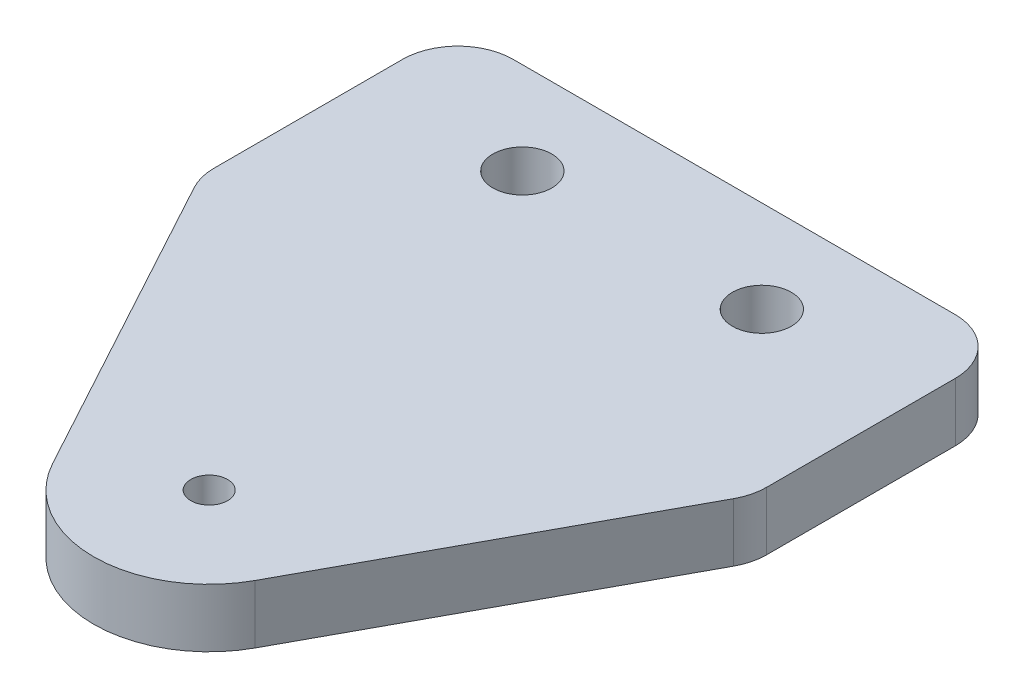
ISO-10303-21;
HEADER;
FILE_DESCRIPTION(('STEP AP214'),'2;1');
FILE_NAME('part.step','',(''),(''),'','','');
FILE_SCHEMA(('AUTOMOTIVE_DESIGN { 1 0 10303 214 1 1 1 1 }'));
ENDSEC;
DATA;
#1=APPLICATION_CONTEXT('core data for automotive mechanical design processes');
#2=APPLICATION_PROTOCOL_DEFINITION('international standard','automotive_design',2000,#1);
#3=PRODUCT_CONTEXT('',#1,'mechanical');
#4=PRODUCT('Part','Part','',(#3));
#5=PRODUCT_RELATED_PRODUCT_CATEGORY('part','',(#4));
#6=PRODUCT_DEFINITION_FORMATION('','',#4);
#7=PRODUCT_DEFINITION_CONTEXT('part definition',#1,'design');
#8=PRODUCT_DEFINITION('design','',#6,#7);
#9=PRODUCT_DEFINITION_SHAPE('','',#8);
#10=(LENGTH_UNIT() NAMED_UNIT(*) SI_UNIT(.MILLI.,.METRE.));
#11=(NAMED_UNIT(*) PLANE_ANGLE_UNIT() SI_UNIT($,.RADIAN.));
#12=(NAMED_UNIT(*) SI_UNIT($,.STERADIAN.) SOLID_ANGLE_UNIT());
#13=UNCERTAINTY_MEASURE_WITH_UNIT(LENGTH_MEASURE(1.E-05),#10,'distance_accuracy_value','');
#14=(GEOMETRIC_REPRESENTATION_CONTEXT(3) GLOBAL_UNCERTAINTY_ASSIGNED_CONTEXT((#13)) GLOBAL_UNIT_ASSIGNED_CONTEXT((#10,
#11,#12)) REPRESENTATION_CONTEXT('',''));
#15=CARTESIAN_POINT('',(0.,0.,0.));
#16=DIRECTION('',(0.,0.,1.));
#17=DIRECTION('',(1.,0.,0.));
#18=AXIS2_PLACEMENT_3D('',#15,#16,#17);
#19=CARTESIAN_POINT('',(0.,3.175,0.));
#20=DIRECTION('',(0.,1.,0.));
#21=DIRECTION('',(0.,0.,1.));
#22=AXIS2_PLACEMENT_3D('',#19,#20,#21);
#23=PLANE('',#22);
#24=DIRECTION('',(-0.477136645791675,0.,0.87882911947811));
#25=VECTOR('',#24,1.);
#26=CARTESIAN_POINT('',(21.4999999999999,3.175,9.));
#27=LINE('',#26,#25);
#28=CARTESIAN_POINT('',(21.1364873584343,3.175,9.66954717799186));
#29=VERTEX_POINT('',#28);
#30=CARTESIAN_POINT('',(11.9988454338963,3.175,26.5));
#31=VERTEX_POINT('',#30);
#32=EDGE_CURVE('E135',#29,#31,#27,.T.);
#33=ORIENTED_EDGE('',*,*,#32,.F.);
#34=CARTESIAN_POINT('',(18.4999999999999,3.175,8.23813724061684));
#35=DIRECTION('',(0.,1.,0.));
#36=DIRECTION('',(0.,0.,1.));
#37=AXIS2_PLACEMENT_3D('',#34,#35,#36);
#38=CIRCLE('',#37,3.);
#39=CARTESIAN_POINT('',(21.4999999999999,3.175,8.23813724061683));
#40=VERTEX_POINT('',#39);
#41=EDGE_CURVE('E196',#29,#40,#38,.T.);
#42=ORIENTED_EDGE('',*,*,#41,.T.);
#43=DIRECTION('',(0.,0.,-1.));
#44=VECTOR('',#43,1.);
#45=CARTESIAN_POINT('',(21.4999999999999,3.175,-5.));
#46=LINE('',#45,#44);
#47=CARTESIAN_POINT('',(21.4999999999999,3.175,-2.));
#48=VERTEX_POINT('',#47);
#49=EDGE_CURVE('E175',#40,#48,#46,.T.);
#50=ORIENTED_EDGE('',*,*,#49,.T.);
#51=CARTESIAN_POINT('',(18.4999999999999,3.175,-2.));
#52=DIRECTION('',(0.,1.,0.));
#53=DIRECTION('',(0.,0.,1.));
#54=AXIS2_PLACEMENT_3D('',#51,#52,#53);
#55=CIRCLE('',#54,3.);
#56=CARTESIAN_POINT('',(18.4999999999999,3.175,-5.));
#57=VERTEX_POINT('',#56);
#58=EDGE_CURVE('E190',#48,#57,#55,.T.);
#59=ORIENTED_EDGE('',*,*,#58,.T.);
#60=DIRECTION('',(-1.,0.,0.));
#61=VECTOR('',#60,1.);
#62=CARTESIAN_POINT('',(-8.49999999999994,3.175,-5.));
#63=LINE('',#62,#61);
#64=CARTESIAN_POINT('',(-5.49999999999994,3.175,-5.));
#65=VERTEX_POINT('',#64);
#66=EDGE_CURVE('E179',#57,#65,#63,.T.);
#67=ORIENTED_EDGE('',*,*,#66,.T.);
#68=CARTESIAN_POINT('',(-5.49999999999994,3.175,-2.));
#69=DIRECTION('',(0.,1.,0.));
#70=DIRECTION('',(0.,0.,1.));
#71=AXIS2_PLACEMENT_3D('',#68,#69,#70);
#72=CIRCLE('',#71,3.);
#73=CARTESIAN_POINT('',(-8.49999999999994,3.175,-2.));
#74=VERTEX_POINT('',#73);
#75=EDGE_CURVE('E192',#65,#74,#72,.T.);
#76=ORIENTED_EDGE('',*,*,#75,.T.);
#77=DIRECTION('',(0.,0.,1.));
#78=VECTOR('',#77,1.);
#79=CARTESIAN_POINT('',(-8.49999999999994,3.175,-5.));
#80=LINE('',#79,#78);
#81=CARTESIAN_POINT('',(-8.49999999999994,3.175,8.23813724061685));
#82=VERTEX_POINT('',#81);
#83=EDGE_CURVE('E172',#74,#82,#80,.T.);
#84=ORIENTED_EDGE('',*,*,#83,.T.);
#85=CARTESIAN_POINT('',(-5.49999999999994,3.175,8.23813724061685));
#86=DIRECTION('',(0.,1.,0.));
#87=DIRECTION('',(0.,0.,1.));
#88=AXIS2_PLACEMENT_3D('',#85,#86,#87);
#89=CIRCLE('',#88,3.);
#90=CARTESIAN_POINT('',(-8.13648735843427,3.175,9.66954717799187));
#91=VERTEX_POINT('',#90);
#92=EDGE_CURVE('E194',#82,#91,#89,.T.);
#93=ORIENTED_EDGE('',*,*,#92,.T.);
#94=DIRECTION('',(-0.477136645791675,0.,-0.878829119478109));
#95=VECTOR('',#94,1.);
#96=CARTESIAN_POINT('',(-8.49999999999994,3.175,9.));
#97=LINE('',#96,#95);
#98=CARTESIAN_POINT('',(1.00115456610374,3.175,26.5));
#99=VERTEX_POINT('',#98);
#100=EDGE_CURVE('E129',#99,#91,#97,.T.);
#101=ORIENTED_EDGE('',*,*,#100,.F.);
#102=CARTESIAN_POINT('',(6.5,3.175,23.5145496912822));
#103=DIRECTION('',(0.,-1.,0.));
#104=DIRECTION('',(0.,0.,-1.));
#105=AXIS2_PLACEMENT_3D('',#102,#103,#104);
#106=CIRCLE('',#105,6.25701323729663);
#107=EDGE_CURVE('E148',#31,#99,#106,.T.);
#108=ORIENTED_EDGE('',*,*,#107,.F.);
#109=EDGE_LOOP('',(#33,#42,#50,#59,#67,#76,#84,#93,#101,#108));
#110=FACE_BOUND('',#109,.T.);
#111=CARTESIAN_POINT('',(6.50000000000051,3.175,23.5000000000016));
#112=DIRECTION('',(0.,1.,0.));
#113=DIRECTION('',(0.,0.,1.));
#114=AXIS2_PLACEMENT_3D('',#111,#112,#113);
#115=CIRCLE('',#114,1.);
#116=CARTESIAN_POINT('',(6.50000000000051,3.175,24.5000000000016));
#117=VERTEX_POINT('',#116);
#118=EDGE_CURVE('E152',#117,#117,#115,.T.);
#119=ORIENTED_EDGE('',*,*,#118,.F.);
#120=EDGE_LOOP('',(#119));
#121=FACE_BOUND('',#120,.T.);
#122=CARTESIAN_POINT('',(0.,3.175,0.));
#123=DIRECTION('',(0.,1.,0.));
#124=DIRECTION('',(0.,0.,1.));
#125=AXIS2_PLACEMENT_3D('',#122,#123,#124);
#126=CIRCLE('',#125,1.6);
#127=CARTESIAN_POINT('',(0.,3.175,1.6));
#128=VERTEX_POINT('',#127);
#129=EDGE_CURVE('E166',#128,#128,#126,.T.);
#130=ORIENTED_EDGE('',*,*,#129,.F.);
#131=EDGE_LOOP('',(#130));
#132=FACE_BOUND('',#131,.T.);
#133=CARTESIAN_POINT('',(13.,3.175,0.));
#134=DIRECTION('',(0.,1.,0.));
#135=DIRECTION('',(0.,0.,1.));
#136=AXIS2_PLACEMENT_3D('',#133,#134,#135);
#137=CIRCLE('',#136,1.6);
#138=CARTESIAN_POINT('',(13.,3.175,1.6));
#139=VERTEX_POINT('',#138);
#140=EDGE_CURVE('E160',#139,#139,#137,.T.);
#141=ORIENTED_EDGE('',*,*,#140,.F.);
#142=EDGE_LOOP('',(#141));
#143=FACE_BOUND('',#142,.T.);
#144=ADVANCED_FACE('F39',(#110,#121,#132,#143),#23,.T.);
#145=CARTESIAN_POINT('',(0.,0.,0.));
#146=DIRECTION('',(0.,1.,0.));
#147=DIRECTION('',(0.,0.,1.));
#148=AXIS2_PLACEMENT_3D('',#145,#146,#147);
#149=PLANE('',#148);
#150=CARTESIAN_POINT('',(6.50000000000051,0.,23.5000000000016));
#151=DIRECTION('',(0.,1.,0.));
#152=DIRECTION('',(0.,0.,1.));
#153=AXIS2_PLACEMENT_3D('',#150,#151,#152);
#154=CIRCLE('',#153,1.);
#155=CARTESIAN_POINT('',(6.50000000000051,0.,24.5000000000016));
#156=VERTEX_POINT('',#155);
#157=EDGE_CURVE('E156',#156,#156,#154,.F.);
#158=ORIENTED_EDGE('',*,*,#157,.F.);
#159=EDGE_LOOP('',(#158));
#160=FACE_BOUND('',#159,.T.);
#161=DIRECTION('',(0.,0.,-1.));
#162=VECTOR('',#161,1.);
#163=CARTESIAN_POINT('',(21.4999999999999,0.,-5.));
#164=LINE('',#163,#162);
#165=CARTESIAN_POINT('',(21.4999999999999,0.,8.23813724061683));
#166=VERTEX_POINT('',#165);
#167=CARTESIAN_POINT('',(21.4999999999999,0.,-2.));
#168=VERTEX_POINT('',#167);
#169=EDGE_CURVE('E185',#166,#168,#164,.T.);
#170=ORIENTED_EDGE('',*,*,#169,.F.);
#171=CARTESIAN_POINT('',(18.4999999999999,0.,8.23813724061684));
#172=DIRECTION('',(0.,1.,0.));
#173=DIRECTION('',(0.,0.,1.));
#174=AXIS2_PLACEMENT_3D('',#171,#172,#173);
#175=CIRCLE('',#174,3.);
#176=CARTESIAN_POINT('',(21.1364873584343,0.,9.66954717799186));
#177=VERTEX_POINT('',#176);
#178=EDGE_CURVE('E125',#166,#177,#175,.F.);
#179=ORIENTED_EDGE('',*,*,#178,.T.);
#180=DIRECTION('',(-0.477136645791675,0.,0.87882911947811));
#181=VECTOR('',#180,1.);
#182=CARTESIAN_POINT('',(21.4999999999999,0.,9.));
#183=LINE('',#182,#181);
#184=CARTESIAN_POINT('',(11.9988454338963,0.,26.5));
#185=VERTEX_POINT('',#184);
#186=EDGE_CURVE('E116',#177,#185,#183,.T.);
#187=ORIENTED_EDGE('',*,*,#186,.T.);
#188=CARTESIAN_POINT('',(6.5,0.,23.5145496912822));
#189=DIRECTION('',(0.,-1.,0.));
#190=DIRECTION('',(0.,0.,-1.));
#191=AXIS2_PLACEMENT_3D('',#188,#189,#190);
#192=CIRCLE('',#191,6.25701323729663);
#193=CARTESIAN_POINT('',(1.00115456610374,0.,26.5));
#194=VERTEX_POINT('',#193);
#195=EDGE_CURVE('E123',#185,#194,#192,.T.);
#196=ORIENTED_EDGE('',*,*,#195,.T.);
#197=DIRECTION('',(-0.477136645791675,0.,-0.878829119478109));
#198=VECTOR('',#197,1.);
#199=CARTESIAN_POINT('',(-8.49999999999994,0.,9.));
#200=LINE('',#199,#198);
#201=CARTESIAN_POINT('',(-8.13648735843427,0.,9.66954717799187));
#202=VERTEX_POINT('',#201);
#203=EDGE_CURVE('E140',#194,#202,#200,.T.);
#204=ORIENTED_EDGE('',*,*,#203,.T.);
#205=CARTESIAN_POINT('',(-5.49999999999994,0.,8.23813724061685));
#206=DIRECTION('',(0.,1.,0.));
#207=DIRECTION('',(0.,0.,1.));
#208=AXIS2_PLACEMENT_3D('',#205,#206,#207);
#209=CIRCLE('',#208,3.);
#210=CARTESIAN_POINT('',(-8.49999999999994,0.,8.23813724061685));
#211=VERTEX_POINT('',#210);
#212=EDGE_CURVE('E204',#202,#211,#209,.F.);
#213=ORIENTED_EDGE('',*,*,#212,.T.);
#214=DIRECTION('',(0.,0.,1.));
#215=VECTOR('',#214,1.);
#216=CARTESIAN_POINT('',(-8.49999999999994,0.,-5.));
#217=LINE('',#216,#215);
#218=CARTESIAN_POINT('',(-8.49999999999994,0.,-2.));
#219=VERTEX_POINT('',#218);
#220=EDGE_CURVE('E169',#219,#211,#217,.T.);
#221=ORIENTED_EDGE('',*,*,#220,.F.);
#222=CARTESIAN_POINT('',(-5.49999999999994,0.,-2.));
#223=DIRECTION('',(0.,1.,0.));
#224=DIRECTION('',(0.,0.,1.));
#225=AXIS2_PLACEMENT_3D('',#222,#223,#224);
#226=CIRCLE('',#225,3.);
#227=CARTESIAN_POINT('',(-5.49999999999994,0.,-5.));
#228=VERTEX_POINT('',#227);
#229=EDGE_CURVE('E54',#219,#228,#226,.F.);
#230=ORIENTED_EDGE('',*,*,#229,.T.);
#231=DIRECTION('',(-1.,0.,0.));
#232=VECTOR('',#231,1.);
#233=CARTESIAN_POINT('',(-8.49999999999994,0.,-5.));
#234=LINE('',#233,#232);
#235=CARTESIAN_POINT('',(18.4999999999999,0.,-5.));
#236=VERTEX_POINT('',#235);
#237=EDGE_CURVE('E176',#236,#228,#234,.T.);
#238=ORIENTED_EDGE('',*,*,#237,.F.);
#239=CARTESIAN_POINT('',(18.4999999999999,0.,-2.));
#240=DIRECTION('',(0.,1.,0.));
#241=DIRECTION('',(0.,0.,1.));
#242=AXIS2_PLACEMENT_3D('',#239,#240,#241);
#243=CIRCLE('',#242,3.);
#244=EDGE_CURVE('E62',#236,#168,#243,.F.);
#245=ORIENTED_EDGE('',*,*,#244,.T.);
#246=EDGE_LOOP('',(#170,#179,#187,#196,#204,#213,#221,#230,#238,#245));
#247=FACE_BOUND('',#246,.T.);
#248=CARTESIAN_POINT('',(0.,0.,0.));
#249=DIRECTION('',(0.,1.,0.));
#250=DIRECTION('',(0.,0.,1.));
#251=AXIS2_PLACEMENT_3D('',#248,#249,#250);
#252=CIRCLE('',#251,1.6);
#253=CARTESIAN_POINT('',(0.,0.,1.6));
#254=VERTEX_POINT('',#253);
#255=EDGE_CURVE('E163',#254,#254,#252,.T.);
#256=ORIENTED_EDGE('',*,*,#255,.T.);
#257=EDGE_LOOP('',(#256));
#258=FACE_BOUND('',#257,.T.);
#259=CARTESIAN_POINT('',(13.,0.,0.));
#260=DIRECTION('',(0.,1.,0.));
#261=DIRECTION('',(0.,0.,1.));
#262=AXIS2_PLACEMENT_3D('',#259,#260,#261);
#263=CIRCLE('',#262,1.6);
#264=CARTESIAN_POINT('',(13.,0.,1.6));
#265=VERTEX_POINT('',#264);
#266=EDGE_CURVE('E159',#265,#265,#263,.T.);
#267=ORIENTED_EDGE('',*,*,#266,.T.);
#268=EDGE_LOOP('',(#267));
#269=FACE_BOUND('',#268,.T.);
#270=ADVANCED_FACE('F119',(#160,#247,#258,#269),#149,.F.);
#271=CARTESIAN_POINT('',(-8.49999999999994,3.175,-5.));
#272=DIRECTION('',(1.,0.,0.));
#273=DIRECTION('',(0.,0.,-1.));
#274=AXIS2_PLACEMENT_3D('',#271,#272,#273);
#275=PLANE('',#274);
#276=ORIENTED_EDGE('',*,*,#220,.T.);
#277=DIRECTION('',(0.,1.,0.));
#278=VECTOR('',#277,1.);
#279=CARTESIAN_POINT('',(-8.49999999999994,3.175,8.23813724061685));
#280=LINE('',#279,#278);
#281=EDGE_CURVE('E210',#211,#82,#280,.T.);
#282=ORIENTED_EDGE('',*,*,#281,.T.);
#283=ORIENTED_EDGE('',*,*,#83,.F.);
#284=DIRECTION('',(0.,-1.,0.));
#285=VECTOR('',#284,1.);
#286=CARTESIAN_POINT('',(-8.49999999999994,3.175,-2.));
#287=LINE('',#286,#285);
#288=EDGE_CURVE('E207',#74,#219,#287,.T.);
#289=ORIENTED_EDGE('',*,*,#288,.T.);
#290=EDGE_LOOP('',(#276,#282,#283,#289));
#291=FACE_BOUND('',#290,.T.);
#292=ADVANCED_FACE('F237',(#291),#275,.F.);
#293=CARTESIAN_POINT('',(21.4999999999999,3.175,-5.));
#294=DIRECTION('',(-1.,0.,0.));
#295=DIRECTION('',(0.,0.,1.));
#296=AXIS2_PLACEMENT_3D('',#293,#294,#295);
#297=PLANE('',#296);
#298=ORIENTED_EDGE('',*,*,#49,.F.);
#299=DIRECTION('',(0.,1.,0.));
#300=VECTOR('',#299,1.);
#301=CARTESIAN_POINT('',(21.4999999999999,3.175,8.23813724061683));
#302=LINE('',#301,#300);
#303=EDGE_CURVE('E200',#40,#166,#302,.F.);
#304=ORIENTED_EDGE('',*,*,#303,.T.);
#305=ORIENTED_EDGE('',*,*,#169,.T.);
#306=DIRECTION('',(0.,-1.,0.));
#307=VECTOR('',#306,1.);
#308=CARTESIAN_POINT('',(21.4999999999999,3.175,-2.));
#309=LINE('',#308,#307);
#310=EDGE_CURVE('E198',#168,#48,#309,.F.);
#311=ORIENTED_EDGE('',*,*,#310,.T.);
#312=EDGE_LOOP('',(#298,#304,#305,#311));
#313=FACE_BOUND('',#312,.T.);
#314=ADVANCED_FACE('F221',(#313),#297,.F.);
#315=CARTESIAN_POINT('',(-8.49999999999994,3.175,-5.));
#316=DIRECTION('',(0.,0.,1.));
#317=DIRECTION('',(1.,0.,0.));
#318=AXIS2_PLACEMENT_3D('',#315,#316,#317);
#319=PLANE('',#318);
#320=ORIENTED_EDGE('',*,*,#237,.T.);
#321=DIRECTION('',(0.,-1.,0.));
#322=VECTOR('',#321,1.);
#323=CARTESIAN_POINT('',(-5.49999999999994,3.175,-5.));
#324=LINE('',#323,#322);
#325=EDGE_CURVE('E11',#228,#65,#324,.F.);
#326=ORIENTED_EDGE('',*,*,#325,.T.);
#327=ORIENTED_EDGE('',*,*,#66,.F.);
#328=DIRECTION('',(0.,-1.,0.));
#329=VECTOR('',#328,1.);
#330=CARTESIAN_POINT('',(18.4999999999999,3.175,-5.));
#331=LINE('',#330,#329);
#332=EDGE_CURVE('E47',#57,#236,#331,.T.);
#333=ORIENTED_EDGE('',*,*,#332,.T.);
#334=EDGE_LOOP('',(#320,#326,#327,#333));
#335=FACE_BOUND('',#334,.T.);
#336=ADVANCED_FACE('F216',(#335),#319,.F.);
#337=CARTESIAN_POINT('',(0.,3.175,0.));
#338=DIRECTION('',(0.,-1.,0.));
#339=DIRECTION('',(0.,0.,-1.));
#340=AXIS2_PLACEMENT_3D('',#337,#338,#339);
#341=CYLINDRICAL_SURFACE('',#340,1.6);
#342=ORIENTED_EDGE('',*,*,#129,.T.);
#343=EDGE_LOOP('',(#342));
#344=FACE_BOUND('',#343,.T.);
#345=ORIENTED_EDGE('',*,*,#255,.F.);
#346=EDGE_LOOP('',(#345));
#347=FACE_BOUND('',#346,.T.);
#348=ADVANCED_FACE('F257',(#344,#347),#341,.F.);
#349=CARTESIAN_POINT('',(13.,3.175,0.));
#350=DIRECTION('',(0.,-1.,0.));
#351=DIRECTION('',(0.,0.,-1.));
#352=AXIS2_PLACEMENT_3D('',#349,#350,#351);
#353=CYLINDRICAL_SURFACE('',#352,1.6);
#354=ORIENTED_EDGE('',*,*,#140,.T.);
#355=EDGE_LOOP('',(#354));
#356=FACE_BOUND('',#355,.T.);
#357=ORIENTED_EDGE('',*,*,#266,.F.);
#358=EDGE_LOOP('',(#357));
#359=FACE_BOUND('',#358,.T.);
#360=ADVANCED_FACE('F279',(#356,#359),#353,.F.);
#361=CARTESIAN_POINT('',(6.50000000000051,-0.00100000000000013,23.5000000000016));
#362=DIRECTION('',(0.,1.,0.));
#363=DIRECTION('',(0.,0.,1.));
#364=AXIS2_PLACEMENT_3D('',#361,#362,#363);
#365=CYLINDRICAL_SURFACE('',#364,1.);
#366=ORIENTED_EDGE('',*,*,#118,.T.);
#367=EDGE_LOOP('',(#366));
#368=FACE_BOUND('',#367,.T.);
#369=ORIENTED_EDGE('',*,*,#157,.T.);
#370=EDGE_LOOP('',(#369));
#371=FACE_BOUND('',#370,.T.);
#372=ADVANCED_FACE('F277',(#368,#371),#365,.F.);
#373=CARTESIAN_POINT('',(-8.49999999999994,0.,9.));
#374=DIRECTION('',(0.878829119478109,0.,-0.477136645791675));
#375=DIRECTION('',(-0.477136645791675,0.,-0.87882911947811));
#376=AXIS2_PLACEMENT_3D('',#373,#374,#375);
#377=PLANE('',#376);
#378=ORIENTED_EDGE('',*,*,#100,.T.);
#379=DIRECTION('',(0.,1.,0.));
#380=VECTOR('',#379,1.);
#381=CARTESIAN_POINT('',(-8.13648735843427,0.,9.66954717799187));
#382=LINE('',#381,#380);
#383=EDGE_CURVE('E213',#91,#202,#382,.F.);
#384=ORIENTED_EDGE('',*,*,#383,.T.);
#385=ORIENTED_EDGE('',*,*,#203,.F.);
#386=DIRECTION('',(0.,1.,0.));
#387=VECTOR('',#386,1.);
#388=CARTESIAN_POINT('',(1.00115456610374,0.,26.5));
#389=LINE('',#388,#387);
#390=EDGE_CURVE('E139',#194,#99,#389,.T.);
#391=ORIENTED_EDGE('',*,*,#390,.T.);
#392=EDGE_LOOP('',(#378,#384,#385,#391));
#393=FACE_BOUND('',#392,.T.);
#394=ADVANCED_FACE('F231',(#393),#377,.F.);
#395=CARTESIAN_POINT('',(6.5,0.,23.5145496912822));
#396=DIRECTION('',(0.,1.,0.));
#397=DIRECTION('',(0.,0.,1.));
#398=AXIS2_PLACEMENT_3D('',#395,#396,#397);
#399=CYLINDRICAL_SURFACE('',#398,6.25701323729663);
#400=ORIENTED_EDGE('',*,*,#107,.T.);
#401=ORIENTED_EDGE('',*,*,#390,.F.);
#402=ORIENTED_EDGE('',*,*,#195,.F.);
#403=DIRECTION('',(0.,1.,0.));
#404=VECTOR('',#403,1.);
#405=CARTESIAN_POINT('',(11.9988454338963,0.,26.5));
#406=LINE('',#405,#404);
#407=EDGE_CURVE('E132',#185,#31,#406,.T.);
#408=ORIENTED_EDGE('',*,*,#407,.T.);
#409=EDGE_LOOP('',(#400,#401,#402,#408));
#410=FACE_BOUND('',#409,.T.);
#411=ADVANCED_FACE('F142',(#410),#399,.T.);
#412=CARTESIAN_POINT('',(21.4999999999999,0.,9.));
#413=DIRECTION('',(-0.87882911947811,0.,-0.477136645791675));
#414=DIRECTION('',(-0.477136645791675,0.,0.87882911947811));
#415=AXIS2_PLACEMENT_3D('',#412,#413,#414);
#416=PLANE('',#415);
#417=ORIENTED_EDGE('',*,*,#186,.F.);
#418=DIRECTION('',(0.,1.,0.));
#419=VECTOR('',#418,1.);
#420=CARTESIAN_POINT('',(21.1364873584343,0.,9.66954717799186));
#421=LINE('',#420,#419);
#422=EDGE_CURVE('E182',#177,#29,#421,.T.);
#423=ORIENTED_EDGE('',*,*,#422,.T.);
#424=ORIENTED_EDGE('',*,*,#32,.T.);
#425=ORIENTED_EDGE('',*,*,#407,.F.);
#426=EDGE_LOOP('',(#417,#423,#424,#425));
#427=FACE_BOUND('',#426,.T.);
#428=ADVANCED_FACE('F133',(#427),#416,.F.);
#429=CARTESIAN_POINT('',(18.4999999999999,0.,8.23813724061684));
#430=DIRECTION('',(0.,1.,0.));
#431=DIRECTION('',(0.,0.,1.));
#432=AXIS2_PLACEMENT_3D('',#429,#430,#431);
#433=CYLINDRICAL_SURFACE('',#432,3.);
#434=ORIENTED_EDGE('',*,*,#178,.F.);
#435=ORIENTED_EDGE('',*,*,#303,.F.);
#436=ORIENTED_EDGE('',*,*,#41,.F.);
#437=ORIENTED_EDGE('',*,*,#422,.F.);
#438=EDGE_LOOP('',(#434,#435,#436,#437));
#439=FACE_BOUND('',#438,.T.);
#440=ADVANCED_FACE('F227',(#439),#433,.T.);
#441=CARTESIAN_POINT('',(-5.49999999999994,3.175,8.23813724061685));
#442=DIRECTION('',(0.,1.,0.));
#443=DIRECTION('',(0.,0.,1.));
#444=AXIS2_PLACEMENT_3D('',#441,#442,#443);
#445=CYLINDRICAL_SURFACE('',#444,3.);
#446=ORIENTED_EDGE('',*,*,#212,.F.);
#447=ORIENTED_EDGE('',*,*,#383,.F.);
#448=ORIENTED_EDGE('',*,*,#92,.F.);
#449=ORIENTED_EDGE('',*,*,#281,.F.);
#450=EDGE_LOOP('',(#446,#447,#448,#449));
#451=FACE_BOUND('',#450,.T.);
#452=ADVANCED_FACE('F234',(#451),#445,.T.);
#453=CARTESIAN_POINT('',(-5.49999999999994,3.175,-2.));
#454=DIRECTION('',(0.,-1.,0.));
#455=DIRECTION('',(0.,0.,-1.));
#456=AXIS2_PLACEMENT_3D('',#453,#454,#455);
#457=CYLINDRICAL_SURFACE('',#456,3.);
#458=ORIENTED_EDGE('',*,*,#75,.F.);
#459=ORIENTED_EDGE('',*,*,#325,.F.);
#460=ORIENTED_EDGE('',*,*,#229,.F.);
#461=ORIENTED_EDGE('',*,*,#288,.F.);
#462=EDGE_LOOP('',(#458,#459,#460,#461));
#463=FACE_BOUND('',#462,.T.);
#464=ADVANCED_FACE('F241',(#463),#457,.T.);
#465=CARTESIAN_POINT('',(18.4999999999999,3.175,-2.));
#466=DIRECTION('',(0.,-1.,0.));
#467=DIRECTION('',(0.,0.,-1.));
#468=AXIS2_PLACEMENT_3D('',#465,#466,#467);
#469=CYLINDRICAL_SURFACE('',#468,3.);
#470=ORIENTED_EDGE('',*,*,#58,.F.);
#471=ORIENTED_EDGE('',*,*,#310,.F.);
#472=ORIENTED_EDGE('',*,*,#244,.F.);
#473=ORIENTED_EDGE('',*,*,#332,.F.);
#474=EDGE_LOOP('',(#470,#471,#472,#473));
#475=FACE_BOUND('',#474,.T.);
#476=ADVANCED_FACE('F41',(#475),#469,.T.);
#477=CLOSED_SHELL('',(#144,#270,#292,#314,#336,#348,#360,#372,#394,#411,#428,#440,#452,#464,#476));
#478=MANIFOLD_SOLID_BREP('B2',#477);
#479=ADVANCED_BREP_SHAPE_REPRESENTATION('',(#18,#478),#14);
#480=SHAPE_DEFINITION_REPRESENTATION(#9,#479);
ENDSEC;
END-ISO-10303-21;
